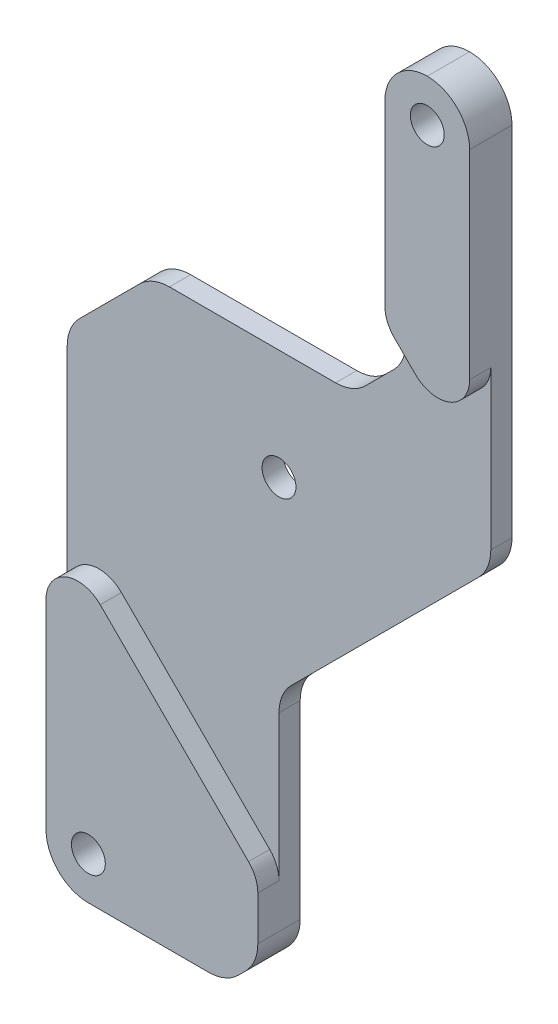
ISO-10303-21;
HEADER;
FILE_DESCRIPTION(('STEP AP214'),'2;1');
FILE_NAME('part.step','',(''),(''),'','','');
FILE_SCHEMA(('AUTOMOTIVE_DESIGN { 1 0 10303 214 1 1 1 1 }'));
ENDSEC;
DATA;
#1=APPLICATION_CONTEXT('core data for automotive mechanical design processes');
#2=APPLICATION_PROTOCOL_DEFINITION('international standard','automotive_design',2000,#1);
#3=PRODUCT_CONTEXT('',#1,'mechanical');
#4=PRODUCT('Part','Part','',(#3));
#5=PRODUCT_RELATED_PRODUCT_CATEGORY('part','',(#4));
#6=PRODUCT_DEFINITION_FORMATION('','',#4);
#7=PRODUCT_DEFINITION_CONTEXT('part definition',#1,'design');
#8=PRODUCT_DEFINITION('design','',#6,#7);
#9=PRODUCT_DEFINITION_SHAPE('','',#8);
#10=(LENGTH_UNIT() NAMED_UNIT(*) SI_UNIT(.MILLI.,.METRE.));
#11=(NAMED_UNIT(*) PLANE_ANGLE_UNIT() SI_UNIT($,.RADIAN.));
#12=(NAMED_UNIT(*) SI_UNIT($,.STERADIAN.) SOLID_ANGLE_UNIT());
#13=UNCERTAINTY_MEASURE_WITH_UNIT(LENGTH_MEASURE(1.E-05),#10,'distance_accuracy_value','');
#14=(GEOMETRIC_REPRESENTATION_CONTEXT(3) GLOBAL_UNCERTAINTY_ASSIGNED_CONTEXT((#13)) GLOBAL_UNIT_ASSIGNED_CONTEXT((#10,
#11,#12)) REPRESENTATION_CONTEXT('',''));
#15=CARTESIAN_POINT('',(0.,0.,0.));
#16=DIRECTION('',(0.,0.,1.));
#17=DIRECTION('',(1.,0.,0.));
#18=AXIS2_PLACEMENT_3D('',#15,#16,#17);
#19=CARTESIAN_POINT('',(0.,0.,4.));
#20=DIRECTION('',(0.,0.,-1.));
#21=DIRECTION('',(-1.,0.,0.));
#22=AXIS2_PLACEMENT_3D('',#19,#20,#21);
#23=PLANE('',#22);
#24=CARTESIAN_POINT('',(-16.,-136.,4.));
#25=DIRECTION('',(0.,0.,1.));
#26=DIRECTION('',(1.,0.,0.));
#27=AXIS2_PLACEMENT_3D('',#24,#25,#26);
#28=CIRCLE('',#27,1.59999999999999);
#29=CARTESIAN_POINT('',(-14.4,-136.,4.));
#30=VERTEX_POINT('',#29);
#31=EDGE_CURVE('E696',#30,#30,#28,.T.);
#32=ORIENTED_EDGE('',*,*,#31,.F.);
#33=EDGE_LOOP('',(#32));
#34=FACE_BOUND('',#33,.T.);
#35=DIRECTION('',(0.,-1.,0.));
#36=VECTOR('',#35,1.);
#37=CARTESIAN_POINT('',(0.,-115.8,4.));
#38=LINE('',#37,#36);
#39=CARTESIAN_POINT('',(0.,-131.18477631085,4.));
#40=VERTEX_POINT('',#39);
#41=CARTESIAN_POINT('',(0.,-135.343145750508,4.));
#42=VERTEX_POINT('',#41);
#43=EDGE_CURVE('E418',#40,#42,#38,.T.);
#44=ORIENTED_EDGE('',*,*,#43,.F.);
#45=CARTESIAN_POINT('',(-3.,-131.18477631085,4.));
#46=DIRECTION('',(0.,0.,-1.));
#47=DIRECTION('',(-1.,0.,0.));
#48=AXIS2_PLACEMENT_3D('',#45,#46,#47);
#49=CIRCLE('',#48,3.);
#50=CARTESIAN_POINT('',(-0.878679656440367,-129.063455967291,4.));
#51=VERTEX_POINT('',#50);
#52=EDGE_CURVE('E307',#40,#51,#49,.F.);
#53=ORIENTED_EDGE('',*,*,#52,.T.);
#54=DIRECTION('',(0.707106781186548,-0.707106781186547,0.));
#55=VECTOR('',#54,1.);
#56=CARTESIAN_POINT('',(0.,-129.942135623731,4.));
#57=LINE('',#56,#55);
#58=CARTESIAN_POINT('',(-14.8786796564404,-115.063455967291,4.));
#59=VERTEX_POINT('',#58);
#60=EDGE_CURVE('E580',#59,#51,#57,.T.);
#61=ORIENTED_EDGE('',*,*,#60,.F.);
#62=CARTESIAN_POINT('',(-17.,-117.18477631085,4.));
#63=DIRECTION('',(0.,0.,-1.));
#64=DIRECTION('',(-1.,0.,0.));
#65=AXIS2_PLACEMENT_3D('',#62,#63,#64);
#66=CIRCLE('',#65,3.);
#67=CARTESIAN_POINT('',(-20.,-117.18477631085,4.));
#68=VERTEX_POINT('',#67);
#69=EDGE_CURVE('E304',#59,#68,#66,.F.);
#70=ORIENTED_EDGE('',*,*,#69,.T.);
#71=DIRECTION('',(0.,1.,0.));
#72=VECTOR('',#71,1.);
#73=CARTESIAN_POINT('',(-20.,-140.,4.));
#74=LINE('',#73,#72);
#75=CARTESIAN_POINT('',(-20.,-136.,4.));
#76=VERTEX_POINT('',#75);
#77=EDGE_CURVE('E384',#76,#68,#74,.T.);
#78=ORIENTED_EDGE('',*,*,#77,.F.);
#79=CARTESIAN_POINT('',(-16.,-136.,4.));
#80=DIRECTION('',(0.,0.,-1.));
#81=DIRECTION('',(-1.,0.,0.));
#82=AXIS2_PLACEMENT_3D('',#79,#80,#81);
#83=CIRCLE('',#82,4.);
#84=CARTESIAN_POINT('',(-16.,-140.,4.));
#85=VERTEX_POINT('',#84);
#86=EDGE_CURVE('E428',#76,#85,#83,.F.);
#87=ORIENTED_EDGE('',*,*,#86,.T.);
#88=DIRECTION('',(-1.,0.,0.));
#89=VECTOR('',#88,1.);
#90=CARTESIAN_POINT('',(0.,-140.,4.));
#91=LINE('',#90,#89);
#92=CARTESIAN_POINT('',(-4.65685424949237,-140.,4.));
#93=VERTEX_POINT('',#92);
#94=EDGE_CURVE('E554',#93,#85,#91,.T.);
#95=ORIENTED_EDGE('',*,*,#94,.F.);
#96=CARTESIAN_POINT('',(-4.65685424949237,-136.,4.));
#97=DIRECTION('',(0.,0.,-1.));
#98=DIRECTION('',(-1.,0.,0.));
#99=AXIS2_PLACEMENT_3D('',#96,#97,#98);
#100=CIRCLE('',#99,4.);
#101=CARTESIAN_POINT('',(-1.82842712474618,-138.828427124746,4.));
#102=VERTEX_POINT('',#101);
#103=EDGE_CURVE('E500',#93,#102,#100,.F.);
#104=ORIENTED_EDGE('',*,*,#103,.T.);
#105=DIRECTION('',(-0.707106781186548,-0.707106781186548,0.));
#106=VECTOR('',#105,1.);
#107=CARTESIAN_POINT('',(0.,-137.,4.));
#108=LINE('',#107,#106);
#109=CARTESIAN_POINT('',(-1.17157287525382,-138.171572875254,4.));
#110=VERTEX_POINT('',#109);
#111=EDGE_CURVE('E456',#102,#110,#108,.F.);
#112=ORIENTED_EDGE('',*,*,#111,.T.);
#113=CARTESIAN_POINT('',(-4.,-135.343145750508,4.));
#114=DIRECTION('',(0.,0.,-1.));
#115=DIRECTION('',(-1.,0.,0.));
#116=AXIS2_PLACEMENT_3D('',#113,#114,#115);
#117=CIRCLE('',#116,4.);
#118=EDGE_CURVE('E496',#110,#42,#117,.F.);
#119=ORIENTED_EDGE('',*,*,#118,.T.);
#120=EDGE_LOOP('',(#44,#53,#61,#70,#78,#87,#95,#104,#112,#119));
#121=FACE_BOUND('',#120,.T.);
#122=ADVANCED_FACE('F39',(#34,#121),#23,.F.);
#123=CARTESIAN_POINT('',(0.,-115.8,4.));
#124=DIRECTION('',(1.,0.,0.));
#125=DIRECTION('',(0.,1.,0.));
#126=AXIS2_PLACEMENT_3D('',#123,#124,#125);
#127=PLANE('',#126);
#128=DIRECTION('',(0.,1.,0.));
#129=VECTOR('',#128,1.);
#130=CARTESIAN_POINT('',(0.,-115.8,2.));
#131=LINE('',#130,#129);
#132=CARTESIAN_POINT('',(0.,-131.18477631085,2.));
#133=VERTEX_POINT('',#132);
#134=CARTESIAN_POINT('',(0.,-117.456854249493,2.));
#135=VERTEX_POINT('',#134);
#136=EDGE_CURVE('E546',#133,#135,#131,.T.);
#137=ORIENTED_EDGE('',*,*,#136,.F.);
#138=DIRECTION('',(0.,0.,1.));
#139=VECTOR('',#138,1.);
#140=CARTESIAN_POINT('',(0.,-131.18477631085,4.));
#141=LINE('',#140,#139);
#142=EDGE_CURVE('E296',#133,#40,#141,.T.);
#143=ORIENTED_EDGE('',*,*,#142,.T.);
#144=ORIENTED_EDGE('',*,*,#43,.T.);
#145=DIRECTION('',(0.,0.,1.));
#146=VECTOR('',#145,1.);
#147=CARTESIAN_POINT('',(0.,-135.343145750508,4.));
#148=LINE('',#147,#146);
#149=CARTESIAN_POINT('',(0.,-135.343145750508,0.));
#150=VERTEX_POINT('',#149);
#151=EDGE_CURVE('E470',#42,#150,#148,.F.);
#152=ORIENTED_EDGE('',*,*,#151,.T.);
#153=DIRECTION('',(0.,-1.,0.));
#154=VECTOR('',#153,1.);
#155=CARTESIAN_POINT('',(0.,-115.8,0.));
#156=LINE('',#155,#154);
#157=CARTESIAN_POINT('',(0.,-117.456854249493,0.));
#158=VERTEX_POINT('',#157);
#159=EDGE_CURVE('E388',#158,#150,#156,.T.);
#160=ORIENTED_EDGE('',*,*,#159,.F.);
#161=DIRECTION('',(0.,0.,-1.));
#162=VECTOR('',#161,1.);
#163=CARTESIAN_POINT('',(0.,-117.456854249493,4.));
#164=LINE('',#163,#162);
#165=EDGE_CURVE('E474',#158,#135,#164,.F.);
#166=ORIENTED_EDGE('',*,*,#165,.T.);
#167=EDGE_LOOP('',(#137,#143,#144,#152,#160,#166));
#168=FACE_BOUND('',#167,.T.);
#169=ADVANCED_FACE('F630',(#168),#127,.T.);
#170=CARTESIAN_POINT('',(0.,-115.8,4.));
#171=DIRECTION('',(-0.707106781186551,0.707106781186544,0.));
#172=DIRECTION('',(-0.707106781186544,-0.707106781186551,0.));
#173=AXIS2_PLACEMENT_3D('',#170,#171,#172);
#174=PLANE('',#173);
#175=DIRECTION('',(0.,0.,-1.));
#176=VECTOR('',#175,1.);
#177=CARTESIAN_POINT('',(18.8284271247462,-96.9715728752538,4.));
#178=LINE('',#177,#176);
#179=CARTESIAN_POINT('',(18.8284271247462,-96.9715728752538,0.));
#180=VERTEX_POINT('',#179);
#181=CARTESIAN_POINT('',(18.8284271247462,-96.9715728752538,2.));
#182=VERTEX_POINT('',#181);
#183=EDGE_CURVE('E463',#180,#182,#178,.F.);
#184=ORIENTED_EDGE('',*,*,#183,.T.);
#185=DIRECTION('',(-0.707106781186544,-0.707106781186551,0.));
#186=VECTOR('',#185,1.);
#187=CARTESIAN_POINT('',(0.,-115.8,2.));
#188=LINE('',#187,#186);
#189=CARTESIAN_POINT('',(1.1715728752538,-114.628427124746,2.));
#190=VERTEX_POINT('',#189);
#191=EDGE_CURVE('E538',#182,#190,#188,.T.);
#192=ORIENTED_EDGE('',*,*,#191,.T.);
#193=DIRECTION('',(0.,0.,-1.));
#194=VECTOR('',#193,1.);
#195=CARTESIAN_POINT('',(1.17157287525379,-114.628427124746,4.));
#196=LINE('',#195,#194);
#197=CARTESIAN_POINT('',(1.1715728752538,-114.628427124746,0.));
#198=VERTEX_POINT('',#197);
#199=EDGE_CURVE('E467',#190,#198,#196,.T.);
#200=ORIENTED_EDGE('',*,*,#199,.T.);
#201=DIRECTION('',(0.707106781186544,0.707106781186552,0.));
#202=VECTOR('',#201,1.);
#203=CARTESIAN_POINT('',(0.,-115.8,0.));
#204=LINE('',#203,#202);
#205=EDGE_CURVE('E415',#198,#180,#204,.T.);
#206=ORIENTED_EDGE('',*,*,#205,.T.);
#207=EDGE_LOOP('',(#184,#192,#200,#206));
#208=FACE_BOUND('',#207,.T.);
#209=ADVANCED_FACE('F641',(#208),#174,.F.);
#210=CARTESIAN_POINT('',(20.,-56.4,4.));
#211=DIRECTION('',(1.,0.,0.));
#212=DIRECTION('',(0.,1.,0.));
#213=AXIS2_PLACEMENT_3D('',#210,#211,#212);
#214=PLANE('',#213);
#215=DIRECTION('',(0.,-1.,0.));
#216=VECTOR('',#215,1.);
#217=CARTESIAN_POINT('',(20.,-56.4,4.));
#218=LINE('',#217,#216);
#219=CARTESIAN_POINT('',(20.,-60.4,4.));
#220=VERTEX_POINT('',#219);
#221=CARTESIAN_POINT('',(20.,-79.2152236891496,4.));
#222=VERTEX_POINT('',#221);
#223=EDGE_CURVE('E367',#220,#222,#218,.T.);
#224=ORIENTED_EDGE('',*,*,#223,.T.);
#225=DIRECTION('',(0.,0.,1.));
#226=VECTOR('',#225,1.);
#227=CARTESIAN_POINT('',(20.,-79.2152236891496,2.));
#228=LINE('',#227,#226);
#229=CARTESIAN_POINT('',(20.,-79.2152236891496,2.));
#230=VERTEX_POINT('',#229);
#231=EDGE_CURVE('E334',#222,#230,#228,.F.);
#232=ORIENTED_EDGE('',*,*,#231,.T.);
#233=DIRECTION('',(0.,1.,0.));
#234=VECTOR('',#233,1.);
#235=CARTESIAN_POINT('',(20.,-56.4,2.));
#236=LINE('',#235,#234);
#237=CARTESIAN_POINT('',(20.,-94.1431457505076,2.));
#238=VERTEX_POINT('',#237);
#239=EDGE_CURVE('E61',#238,#230,#236,.T.);
#240=ORIENTED_EDGE('',*,*,#239,.F.);
#241=DIRECTION('',(0.,0.,-1.));
#242=VECTOR('',#241,1.);
#243=CARTESIAN_POINT('',(20.,-94.1431457505076,0.));
#244=LINE('',#243,#242);
#245=CARTESIAN_POINT('',(20.,-94.1431457505076,0.));
#246=VERTEX_POINT('',#245);
#247=EDGE_CURVE('E478',#238,#246,#244,.T.);
#248=ORIENTED_EDGE('',*,*,#247,.T.);
#249=DIRECTION('',(0.,-1.,0.));
#250=VECTOR('',#249,1.);
#251=CARTESIAN_POINT('',(20.,-56.4,0.));
#252=LINE('',#251,#250);
#253=CARTESIAN_POINT('',(20.,-60.4,0.));
#254=VERTEX_POINT('',#253);
#255=EDGE_CURVE('E411',#254,#246,#252,.T.);
#256=ORIENTED_EDGE('',*,*,#255,.F.);
#257=DIRECTION('',(0.,0.,-1.));
#258=VECTOR('',#257,1.);
#259=CARTESIAN_POINT('',(20.,-60.4,4.));
#260=LINE('',#259,#258);
#261=EDGE_CURVE('E374',#254,#220,#260,.F.);
#262=ORIENTED_EDGE('',*,*,#261,.T.);
#263=EDGE_LOOP('',(#224,#232,#240,#248,#256,#262));
#264=FACE_BOUND('',#263,.T.);
#265=ADVANCED_FACE('F371',(#264),#214,.T.);
#266=CARTESIAN_POINT('',(12.0000000000001,-87.8,4.));
#267=DIRECTION('',(-1.,0.,0.));
#268=DIRECTION('',(0.,-1.,0.));
#269=AXIS2_PLACEMENT_3D('',#266,#267,#268);
#270=PLANE('',#269);
#271=DIRECTION('',(0.,-1.,0.));
#272=VECTOR('',#271,1.);
#273=CARTESIAN_POINT('',(12.0000000000001,-87.8,2.));
#274=LINE('',#273,#272);
#275=CARTESIAN_POINT('',(12.0000000000001,-77.2152236891497,2.));
#276=VERTEX_POINT('',#275);
#277=CARTESIAN_POINT('',(12.0000000000001,-81.1431457505076,2.));
#278=VERTEX_POINT('',#277);
#279=EDGE_CURVE('E234',#276,#278,#274,.T.);
#280=ORIENTED_EDGE('',*,*,#279,.F.);
#281=DIRECTION('',(0.,0.,-1.));
#282=VECTOR('',#281,1.);
#283=CARTESIAN_POINT('',(12.0000000000001,-77.2152236891497,4.));
#284=LINE('',#283,#282);
#285=CARTESIAN_POINT('',(12.0000000000001,-77.2152236891497,4.));
#286=VERTEX_POINT('',#285);
#287=EDGE_CURVE('E325',#276,#286,#284,.F.);
#288=ORIENTED_EDGE('',*,*,#287,.T.);
#289=DIRECTION('',(0.,1.,0.));
#290=VECTOR('',#289,1.);
#291=CARTESIAN_POINT('',(12.0000000000001,-87.8,4.));
#292=LINE('',#291,#290);
#293=CARTESIAN_POINT('',(12.0000000000001,-60.4,4.));
#294=VERTEX_POINT('',#293);
#295=EDGE_CURVE('E377',#286,#294,#292,.T.);
#296=ORIENTED_EDGE('',*,*,#295,.T.);
#297=DIRECTION('',(0.,0.,-1.));
#298=VECTOR('',#297,1.);
#299=CARTESIAN_POINT('',(12.0000000000001,-60.4,4.));
#300=LINE('',#299,#298);
#301=CARTESIAN_POINT('',(12.0000000000001,-60.4,0.));
#302=VERTEX_POINT('',#301);
#303=EDGE_CURVE('E376',#294,#302,#300,.T.);
#304=ORIENTED_EDGE('',*,*,#303,.T.);
#305=DIRECTION('',(0.,1.,0.));
#306=VECTOR('',#305,1.);
#307=CARTESIAN_POINT('',(12.0000000000001,-87.8,0.));
#308=LINE('',#307,#306);
#309=CARTESIAN_POINT('',(12.0000000000001,-81.1431457505076,0.));
#310=VERTEX_POINT('',#309);
#311=EDGE_CURVE('E408',#310,#302,#308,.T.);
#312=ORIENTED_EDGE('',*,*,#311,.F.);
#313=DIRECTION('',(0.,0.,-1.));
#314=VECTOR('',#313,1.);
#315=CARTESIAN_POINT('',(12.0000000000001,-81.1431457505076,4.));
#316=LINE('',#315,#314);
#317=EDGE_CURVE('E285',#310,#278,#316,.F.);
#318=ORIENTED_EDGE('',*,*,#317,.T.);
#319=EDGE_LOOP('',(#280,#288,#296,#304,#312,#318));
#320=FACE_BOUND('',#319,.T.);
#321=ADVANCED_FACE('F660',(#320),#270,.T.);
#322=CARTESIAN_POINT('',(-12.,-87.8,4.));
#323=DIRECTION('',(0.,1.,0.));
#324=DIRECTION('',(0.,0.,1.));
#325=AXIS2_PLACEMENT_3D('',#322,#323,#324);
#326=PLANE('',#325);
#327=DIRECTION('',(-1.,0.,0.));
#328=VECTOR('',#327,1.);
#329=CARTESIAN_POINT('',(-12.,-87.8,2.));
#330=LINE('',#329,#328);
#331=CARTESIAN_POINT('',(5.34314575050766,-87.8,2.));
#332=VERTEX_POINT('',#331);
#333=CARTESIAN_POINT('',(-10.3431457505076,-87.8,2.));
#334=VERTEX_POINT('',#333);
#335=EDGE_CURVE('E509',#332,#334,#330,.T.);
#336=ORIENTED_EDGE('',*,*,#335,.F.);
#337=DIRECTION('',(0.,0.,1.));
#338=VECTOR('',#337,1.);
#339=CARTESIAN_POINT('',(5.34314575050766,-87.8,4.));
#340=LINE('',#339,#338);
#341=CARTESIAN_POINT('',(5.34314575050766,-87.8,0.));
#342=VERTEX_POINT('',#341);
#343=EDGE_CURVE('E256',#332,#342,#340,.F.);
#344=ORIENTED_EDGE('',*,*,#343,.T.);
#345=DIRECTION('',(1.,0.,0.));
#346=VECTOR('',#345,1.);
#347=CARTESIAN_POINT('',(-12.,-87.8,0.));
#348=LINE('',#347,#346);
#349=CARTESIAN_POINT('',(-10.3431457505076,-87.8,0.));
#350=VERTEX_POINT('',#349);
#351=EDGE_CURVE('E404',#350,#342,#348,.T.);
#352=ORIENTED_EDGE('',*,*,#351,.F.);
#353=DIRECTION('',(0.,0.,-1.));
#354=VECTOR('',#353,1.);
#355=CARTESIAN_POINT('',(-10.3431457505076,-87.8,4.));
#356=LINE('',#355,#354);
#357=EDGE_CURVE('E262',#350,#334,#356,.F.);
#358=ORIENTED_EDGE('',*,*,#357,.T.);
#359=EDGE_LOOP('',(#336,#344,#352,#358));
#360=FACE_BOUND('',#359,.T.);
#361=ADVANCED_FACE('F508',(#360),#326,.T.);
#362=CARTESIAN_POINT('',(-20.,-95.8,4.));
#363=DIRECTION('',(-0.707106781186548,0.707106781186547,0.));
#364=DIRECTION('',(-0.707106781186547,-0.707106781186548,0.));
#365=AXIS2_PLACEMENT_3D('',#362,#363,#364);
#366=PLANE('',#365);
#367=DIRECTION('',(-0.707106781186547,-0.707106781186548,0.));
#368=VECTOR('',#367,1.);
#369=CARTESIAN_POINT('',(-20.,-95.8,2.));
#370=LINE('',#369,#368);
#371=CARTESIAN_POINT('',(-13.1715728752538,-88.9715728752538,2.));
#372=VERTEX_POINT('',#371);
#373=CARTESIAN_POINT('',(-18.8284271247462,-94.6284271247462,2.));
#374=VERTEX_POINT('',#373);
#375=EDGE_CURVE('E519',#372,#374,#370,.T.);
#376=ORIENTED_EDGE('',*,*,#375,.F.);
#377=DIRECTION('',(0.,0.,-1.));
#378=VECTOR('',#377,1.);
#379=CARTESIAN_POINT('',(-13.1715728752538,-88.9715728752538,4.));
#380=LINE('',#379,#378);
#381=CARTESIAN_POINT('',(-13.1715728752538,-88.9715728752538,0.));
#382=VERTEX_POINT('',#381);
#383=EDGE_CURVE('E269',#372,#382,#380,.T.);
#384=ORIENTED_EDGE('',*,*,#383,.T.);
#385=DIRECTION('',(0.707106781186547,0.707106781186548,0.));
#386=VECTOR('',#385,1.);
#387=CARTESIAN_POINT('',(-20.,-95.8,0.));
#388=LINE('',#387,#386);
#389=CARTESIAN_POINT('',(-18.8284271247462,-94.6284271247462,0.));
#390=VERTEX_POINT('',#389);
#391=EDGE_CURVE('E400',#390,#382,#388,.T.);
#392=ORIENTED_EDGE('',*,*,#391,.F.);
#393=DIRECTION('',(0.,0.,-1.));
#394=VECTOR('',#393,1.);
#395=CARTESIAN_POINT('',(-18.8284271247462,-94.6284271247462,4.));
#396=LINE('',#395,#394);
#397=EDGE_CURVE('E260',#390,#374,#396,.F.);
#398=ORIENTED_EDGE('',*,*,#397,.T.);
#399=EDGE_LOOP('',(#376,#384,#392,#398));
#400=FACE_BOUND('',#399,.T.);
#401=ADVANCED_FACE('F600',(#400),#366,.T.);
#402=CARTESIAN_POINT('',(-20.,-140.,4.));
#403=DIRECTION('',(-1.,0.,0.));
#404=DIRECTION('',(0.,-1.,0.));
#405=AXIS2_PLACEMENT_3D('',#402,#403,#404);
#406=PLANE('',#405);
#407=ORIENTED_EDGE('',*,*,#77,.T.);
#408=DIRECTION('',(0.,0.,1.));
#409=VECTOR('',#408,1.);
#410=CARTESIAN_POINT('',(-20.,-117.18477631085,2.));
#411=LINE('',#410,#409);
#412=CARTESIAN_POINT('',(-20.,-117.18477631085,2.));
#413=VERTEX_POINT('',#412);
#414=EDGE_CURVE('E337',#68,#413,#411,.F.);
#415=ORIENTED_EDGE('',*,*,#414,.T.);
#416=DIRECTION('',(0.,-1.,0.));
#417=VECTOR('',#416,1.);
#418=CARTESIAN_POINT('',(-20.,-140.,2.));
#419=LINE('',#418,#417);
#420=CARTESIAN_POINT('',(-20.,-97.4568542494924,2.));
#421=VERTEX_POINT('',#420);
#422=EDGE_CURVE('E54',#421,#413,#419,.T.);
#423=ORIENTED_EDGE('',*,*,#422,.F.);
#424=DIRECTION('',(0.,0.,-1.));
#425=VECTOR('',#424,1.);
#426=CARTESIAN_POINT('',(-20.,-97.4568542494924,4.));
#427=LINE('',#426,#425);
#428=CARTESIAN_POINT('',(-20.,-97.4568542494924,0.));
#429=VERTEX_POINT('',#428);
#430=EDGE_CURVE('E272',#421,#429,#427,.T.);
#431=ORIENTED_EDGE('',*,*,#430,.T.);
#432=DIRECTION('',(0.,1.,0.));
#433=VECTOR('',#432,1.);
#434=CARTESIAN_POINT('',(-20.,-140.,0.));
#435=LINE('',#434,#433);
#436=CARTESIAN_POINT('',(-20.,-136.,0.));
#437=VERTEX_POINT('',#436);
#438=EDGE_CURVE('E396',#437,#429,#435,.T.);
#439=ORIENTED_EDGE('',*,*,#438,.F.);
#440=DIRECTION('',(0.,0.,-1.));
#441=VECTOR('',#440,1.);
#442=CARTESIAN_POINT('',(-20.,-136.,4.));
#443=LINE('',#442,#441);
#444=EDGE_CURVE('E445',#437,#76,#443,.F.);
#445=ORIENTED_EDGE('',*,*,#444,.T.);
#446=EDGE_LOOP('',(#407,#415,#423,#431,#439,#445));
#447=FACE_BOUND('',#446,.T.);
#448=ADVANCED_FACE('F561',(#447),#406,.T.);
#449=CARTESIAN_POINT('',(0.,-140.,4.));
#450=DIRECTION('',(0.,-1.,0.));
#451=DIRECTION('',(0.,0.,-1.));
#452=AXIS2_PLACEMENT_3D('',#449,#450,#451);
#453=PLANE('',#452);
#454=DIRECTION('',(-1.,0.,0.));
#455=VECTOR('',#454,1.);
#456=CARTESIAN_POINT('',(0.,-140.,0.));
#457=LINE('',#456,#455);
#458=CARTESIAN_POINT('',(-4.65685424949237,-140.,0.));
#459=VERTEX_POINT('',#458);
#460=CARTESIAN_POINT('',(-16.,-140.,0.));
#461=VERTEX_POINT('',#460);
#462=EDGE_CURVE('E392',#459,#461,#457,.T.);
#463=ORIENTED_EDGE('',*,*,#462,.F.);
#464=DIRECTION('',(0.,0.,-1.));
#465=VECTOR('',#464,1.);
#466=CARTESIAN_POINT('',(-4.65685424949237,-140.,4.));
#467=LINE('',#466,#465);
#468=EDGE_CURVE('E275',#459,#93,#467,.F.);
#469=ORIENTED_EDGE('',*,*,#468,.T.);
#470=ORIENTED_EDGE('',*,*,#94,.T.);
#471=DIRECTION('',(0.,0.,-1.));
#472=VECTOR('',#471,1.);
#473=CARTESIAN_POINT('',(-16.,-140.,4.));
#474=LINE('',#473,#472);
#475=EDGE_CURVE('E441',#85,#461,#474,.T.);
#476=ORIENTED_EDGE('',*,*,#475,.T.);
#477=EDGE_LOOP('',(#463,#469,#470,#476));
#478=FACE_BOUND('',#477,.T.);
#479=ADVANCED_FACE('F614',(#478),#453,.T.);
#480=CARTESIAN_POINT('',(16.0000000000001,-60.4,4.));
#481=DIRECTION('',(0.,0.,1.));
#482=DIRECTION('',(1.,0.,0.));
#483=AXIS2_PLACEMENT_3D('',#480,#481,#482);
#484=CIRCLE('',#483,1.6);
#485=CARTESIAN_POINT('',(17.6000000000001,-60.4,4.));
#486=VERTEX_POINT('',#485);
#487=EDGE_CURVE('E583',#486,#486,#484,.T.);
#488=ORIENTED_EDGE('',*,*,#487,.F.);
#489=EDGE_LOOP('',(#488));
#490=FACE_BOUND('',#489,.T.);
#491=ORIENTED_EDGE('',*,*,#295,.F.);
#492=CARTESIAN_POINT('',(15.0000000000001,-77.2152236891497,4.));
#493=DIRECTION('',(0.,0.,-1.));
#494=DIRECTION('',(-1.,0.,0.));
#495=AXIS2_PLACEMENT_3D('',#492,#493,#494);
#496=CIRCLE('',#495,3.);
#497=CARTESIAN_POINT('',(12.8786796564404,-79.3365440327093,4.));
#498=VERTEX_POINT('',#497);
#499=EDGE_CURVE('E331',#286,#498,#496,.F.);
#500=ORIENTED_EDGE('',*,*,#499,.T.);
#501=DIRECTION('',(-0.707106781186548,0.707106781186547,0.));
#502=VECTOR('',#501,1.);
#503=CARTESIAN_POINT('',(31.7421356237311,-98.2,4.));
#504=LINE('',#503,#502);
#505=CARTESIAN_POINT('',(14.8786796564404,-81.3365440327092,4.));
#506=VERTEX_POINT('',#505);
#507=EDGE_CURVE('E369',#506,#498,#504,.T.);
#508=ORIENTED_EDGE('',*,*,#507,.F.);
#509=CARTESIAN_POINT('',(17.,-79.2152236891496,4.));
#510=DIRECTION('',(0.,0.,-1.));
#511=DIRECTION('',(-1.,0.,0.));
#512=AXIS2_PLACEMENT_3D('',#509,#510,#511);
#513=CIRCLE('',#512,3.);
#514=EDGE_CURVE('E328',#506,#222,#513,.F.);
#515=ORIENTED_EDGE('',*,*,#514,.T.);
#516=ORIENTED_EDGE('',*,*,#223,.F.);
#517=CARTESIAN_POINT('',(16.,-60.4,4.));
#518=DIRECTION('',(0.,0.,-1.));
#519=DIRECTION('',(-1.,0.,0.));
#520=AXIS2_PLACEMENT_3D('',#517,#518,#519);
#521=CIRCLE('',#520,4.);
#522=CARTESIAN_POINT('',(16.,-56.4,4.));
#523=VERTEX_POINT('',#522);
#524=EDGE_CURVE('E432',#220,#523,#521,.F.);
#525=ORIENTED_EDGE('',*,*,#524,.T.);
#526=CARTESIAN_POINT('',(16.0000000000001,-60.4,4.));
#527=DIRECTION('',(0.,0.,-1.));
#528=DIRECTION('',(-1.,0.,0.));
#529=AXIS2_PLACEMENT_3D('',#526,#527,#528);
#530=CIRCLE('',#529,4.);
#531=EDGE_CURVE('E435',#523,#294,#530,.F.);
#532=ORIENTED_EDGE('',*,*,#531,.T.);
#533=EDGE_LOOP('',(#491,#500,#508,#515,#516,#525,#532));
#534=FACE_BOUND('',#533,.T.);
#535=ADVANCED_FACE('F366',(#490,#534),#23,.F.);
#536=CARTESIAN_POINT('',(0.,0.,0.));
#537=DIRECTION('',(0.,0.,-1.));
#538=DIRECTION('',(-1.,0.,0.));
#539=AXIS2_PLACEMENT_3D('',#536,#537,#538);
#540=PLANE('',#539);
#541=CARTESIAN_POINT('',(-16.,-136.,0.));
#542=DIRECTION('',(0.,0.,1.));
#543=DIRECTION('',(1.,0.,0.));
#544=AXIS2_PLACEMENT_3D('',#541,#542,#543);
#545=CIRCLE('',#544,1.59999999999999);
#546=CARTESIAN_POINT('',(-14.4,-136.,0.));
#547=VERTEX_POINT('',#546);
#548=EDGE_CURVE('E587',#547,#547,#545,.T.);
#549=ORIENTED_EDGE('',*,*,#548,.T.);
#550=EDGE_LOOP('',(#549));
#551=FACE_BOUND('',#550,.T.);
#552=CARTESIAN_POINT('',(16.0000000000001,-60.4,0.));
#553=DIRECTION('',(0.,0.,1.));
#554=DIRECTION('',(1.,0.,0.));
#555=AXIS2_PLACEMENT_3D('',#552,#553,#554);
#556=CIRCLE('',#555,1.6);
#557=CARTESIAN_POINT('',(17.6000000000001,-60.4,0.));
#558=VERTEX_POINT('',#557);
#559=EDGE_CURVE('E693',#558,#558,#556,.T.);
#560=ORIENTED_EDGE('',*,*,#559,.T.);
#561=EDGE_LOOP('',(#560));
#562=FACE_BOUND('',#561,.T.);
#563=CARTESIAN_POINT('',(0.,-98.2,0.));
#564=DIRECTION('',(0.,0.,1.));
#565=DIRECTION('',(1.,0.,0.));
#566=AXIS2_PLACEMENT_3D('',#563,#564,#565);
#567=CIRCLE('',#566,1.6);
#568=CARTESIAN_POINT('',(1.6,-98.2,0.));
#569=VERTEX_POINT('',#568);
#570=EDGE_CURVE('E452',#569,#569,#567,.T.);
#571=ORIENTED_EDGE('',*,*,#570,.T.);
#572=EDGE_LOOP('',(#571));
#573=FACE_BOUND('',#572,.T.);
#574=ORIENTED_EDGE('',*,*,#255,.T.);
#575=CARTESIAN_POINT('',(16.,-94.1431457505076,0.));
#576=DIRECTION('',(0.,0.,-1.));
#577=DIRECTION('',(-1.,0.,0.));
#578=AXIS2_PLACEMENT_3D('',#575,#576,#577);
#579=CIRCLE('',#578,4.);
#580=EDGE_CURVE('E493',#246,#180,#579,.T.);
#581=ORIENTED_EDGE('',*,*,#580,.T.);
#582=ORIENTED_EDGE('',*,*,#205,.F.);
#583=CARTESIAN_POINT('',(4.,-117.456854249493,0.));
#584=DIRECTION('',(0.,0.,-1.));
#585=DIRECTION('',(-1.,0.,0.));
#586=AXIS2_PLACEMENT_3D('',#583,#584,#585);
#587=CIRCLE('',#586,4.);
#588=EDGE_CURVE('E288',#198,#158,#587,.F.);
#589=ORIENTED_EDGE('',*,*,#588,.T.);
#590=ORIENTED_EDGE('',*,*,#159,.T.);
#591=CARTESIAN_POINT('',(-4.,-135.343145750508,0.));
#592=DIRECTION('',(0.,0.,-1.));
#593=DIRECTION('',(-1.,0.,0.));
#594=AXIS2_PLACEMENT_3D('',#591,#592,#593);
#595=CIRCLE('',#594,4.);
#596=CARTESIAN_POINT('',(-1.17157287525384,-138.171572875254,0.));
#597=VERTEX_POINT('',#596);
#598=EDGE_CURVE('E481',#150,#597,#595,.T.);
#599=ORIENTED_EDGE('',*,*,#598,.T.);
#600=DIRECTION('',(0.707106781186548,0.707106781186548,0.));
#601=VECTOR('',#600,1.);
#602=CARTESIAN_POINT('',(68.5,-68.5,0.));
#603=LINE('',#602,#601);
#604=CARTESIAN_POINT('',(-1.82842712474619,-138.828427124746,0.));
#605=VERTEX_POINT('',#604);
#606=EDGE_CURVE('E448',#597,#605,#603,.F.);
#607=ORIENTED_EDGE('',*,*,#606,.T.);
#608=CARTESIAN_POINT('',(-4.65685424949237,-136.,0.));
#609=DIRECTION('',(0.,0.,-1.));
#610=DIRECTION('',(-1.,0.,0.));
#611=AXIS2_PLACEMENT_3D('',#608,#609,#610);
#612=CIRCLE('',#611,4.);
#613=EDGE_CURVE('E484',#605,#459,#612,.T.);
#614=ORIENTED_EDGE('',*,*,#613,.T.);
#615=ORIENTED_EDGE('',*,*,#462,.T.);
#616=CARTESIAN_POINT('',(-16.,-136.,0.));
#617=DIRECTION('',(0.,0.,-1.));
#618=DIRECTION('',(-1.,0.,0.));
#619=AXIS2_PLACEMENT_3D('',#616,#617,#618);
#620=CIRCLE('',#619,4.);
#621=EDGE_CURVE('E382',#461,#437,#620,.T.);
#622=ORIENTED_EDGE('',*,*,#621,.T.);
#623=ORIENTED_EDGE('',*,*,#438,.T.);
#624=CARTESIAN_POINT('',(-16.,-97.4568542494924,0.));
#625=DIRECTION('',(0.,0.,-1.));
#626=DIRECTION('',(-1.,0.,0.));
#627=AXIS2_PLACEMENT_3D('',#624,#625,#626);
#628=CIRCLE('',#627,4.);
#629=EDGE_CURVE('E487',#429,#390,#628,.T.);
#630=ORIENTED_EDGE('',*,*,#629,.T.);
#631=ORIENTED_EDGE('',*,*,#391,.T.);
#632=CARTESIAN_POINT('',(-10.3431457505076,-91.8,0.));
#633=DIRECTION('',(0.,0.,-1.));
#634=DIRECTION('',(-1.,0.,0.));
#635=AXIS2_PLACEMENT_3D('',#632,#633,#634);
#636=CIRCLE('',#635,4.);
#637=EDGE_CURVE('E490',#382,#350,#636,.T.);
#638=ORIENTED_EDGE('',*,*,#637,.T.);
#639=ORIENTED_EDGE('',*,*,#351,.T.);
#640=CARTESIAN_POINT('',(5.34314575050766,-83.8,0.));
#641=DIRECTION('',(0.,0.,-1.));
#642=DIRECTION('',(-1.,0.,0.));
#643=AXIS2_PLACEMENT_3D('',#640,#641,#642);
#644=CIRCLE('',#643,4.);
#645=CARTESIAN_POINT('',(8.17157287525383,-86.6284271247462,0.));
#646=VERTEX_POINT('',#645);
#647=EDGE_CURVE('E291',#342,#646,#644,.F.);
#648=ORIENTED_EDGE('',*,*,#647,.T.);
#649=DIRECTION('',(-0.707106781186551,-0.707106781186544,0.));
#650=VECTOR('',#649,1.);
#651=CARTESIAN_POINT('',(7.00000000000002,-87.8,0.));
#652=LINE('',#651,#650);
#653=CARTESIAN_POINT('',(10.8284271247462,-83.9715728752538,0.));
#654=VERTEX_POINT('',#653);
#655=EDGE_CURVE('E460',#646,#654,#652,.F.);
#656=ORIENTED_EDGE('',*,*,#655,.T.);
#657=CARTESIAN_POINT('',(8.00000000000007,-81.1431457505076,0.));
#658=DIRECTION('',(0.,0.,-1.));
#659=DIRECTION('',(-1.,0.,0.));
#660=AXIS2_PLACEMENT_3D('',#657,#658,#659);
#661=CIRCLE('',#660,4.);
#662=EDGE_CURVE('E254',#654,#310,#661,.F.);
#663=ORIENTED_EDGE('',*,*,#662,.T.);
#664=ORIENTED_EDGE('',*,*,#311,.T.);
#665=CARTESIAN_POINT('',(16.0000000000001,-60.4,0.));
#666=DIRECTION('',(0.,0.,-1.));
#667=DIRECTION('',(-1.,0.,0.));
#668=AXIS2_PLACEMENT_3D('',#665,#666,#667);
#669=CIRCLE('',#668,4.);
#670=CARTESIAN_POINT('',(16.,-56.4,0.));
#671=VERTEX_POINT('',#670);
#672=EDGE_CURVE('E425',#302,#671,#669,.T.);
#673=ORIENTED_EDGE('',*,*,#672,.T.);
#674=CARTESIAN_POINT('',(16.,-60.4,0.));
#675=DIRECTION('',(0.,0.,-1.));
#676=DIRECTION('',(-1.,0.,0.));
#677=AXIS2_PLACEMENT_3D('',#674,#675,#676);
#678=CIRCLE('',#677,4.);
#679=EDGE_CURVE('E422',#671,#254,#678,.T.);
#680=ORIENTED_EDGE('',*,*,#679,.T.);
#681=EDGE_LOOP('',(#574,#581,#582,#589,#590,#599,#607,#614,#615,#622,#623,#630,#631,#638,#639,
#648,#656,#663,#664,#673,#680));
#682=FACE_BOUND('',#681,.T.);
#683=ADVANCED_FACE('F595',(#551,#562,#573,#682),#540,.T.);
#684=CARTESIAN_POINT('',(16.,-60.4,4.));
#685=DIRECTION('',(0.,0.,-1.));
#686=DIRECTION('',(-1.,0.,0.));
#687=AXIS2_PLACEMENT_3D('',#684,#685,#686);
#688=CYLINDRICAL_SURFACE('',#687,4.);
#689=DIRECTION('',(0.,0.,-1.));
#690=VECTOR('',#689,1.);
#691=CARTESIAN_POINT('',(16.,-56.4,4.));
#692=LINE('',#691,#690);
#693=EDGE_CURVE('E393',#523,#671,#692,.T.);
#694=ORIENTED_EDGE('',*,*,#693,.F.);
#695=ORIENTED_EDGE('',*,*,#524,.F.);
#696=ORIENTED_EDGE('',*,*,#261,.F.);
#697=ORIENTED_EDGE('',*,*,#679,.F.);
#698=EDGE_LOOP('',(#694,#695,#696,#697));
#699=FACE_BOUND('',#698,.T.);
#700=ADVANCED_FACE('F651',(#699),#688,.T.);
#701=CARTESIAN_POINT('',(16.0000000000001,-60.4,4.));
#702=DIRECTION('',(0.,0.,-1.));
#703=DIRECTION('',(-1.,0.,0.));
#704=AXIS2_PLACEMENT_3D('',#701,#702,#703);
#705=CYLINDRICAL_SURFACE('',#704,4.);
#706=ORIENTED_EDGE('',*,*,#531,.F.);
#707=ORIENTED_EDGE('',*,*,#693,.T.);
#708=ORIENTED_EDGE('',*,*,#672,.F.);
#709=ORIENTED_EDGE('',*,*,#303,.F.);
#710=EDGE_LOOP('',(#706,#707,#708,#709));
#711=FACE_BOUND('',#710,.T.);
#712=ADVANCED_FACE('F657',(#711),#705,.T.);
#713=CARTESIAN_POINT('',(-16.,-136.,4.));
#714=DIRECTION('',(0.,0.,-1.));
#715=DIRECTION('',(-1.,0.,0.));
#716=AXIS2_PLACEMENT_3D('',#713,#714,#715);
#717=CYLINDRICAL_SURFACE('',#716,4.);
#718=ORIENTED_EDGE('',*,*,#86,.F.);
#719=ORIENTED_EDGE('',*,*,#444,.F.);
#720=ORIENTED_EDGE('',*,*,#621,.F.);
#721=ORIENTED_EDGE('',*,*,#475,.F.);
#722=EDGE_LOOP('',(#718,#719,#720,#721));
#723=FACE_BOUND('',#722,.T.);
#724=ADVANCED_FACE('F607',(#723),#717,.T.);
#725=CARTESIAN_POINT('',(0.,-137.,4.));
#726=DIRECTION('',(-0.707106781186547,0.707106781186547,0.));
#727=DIRECTION('',(0.,0.,-1.));
#728=AXIS2_PLACEMENT_3D('',#725,#726,#727);
#729=PLANE('',#728);
#730=ORIENTED_EDGE('',*,*,#111,.F.);
#731=DIRECTION('',(0.,0.,1.));
#732=VECTOR('',#731,1.);
#733=CARTESIAN_POINT('',(-1.82842712474618,-138.828427124746,4.));
#734=LINE('',#733,#732);
#735=EDGE_CURVE('E282',#102,#605,#734,.F.);
#736=ORIENTED_EDGE('',*,*,#735,.T.);
#737=ORIENTED_EDGE('',*,*,#606,.F.);
#738=DIRECTION('',(0.,0.,-1.));
#739=VECTOR('',#738,1.);
#740=CARTESIAN_POINT('',(-1.17157287525382,-138.171572875254,4.));
#741=LINE('',#740,#739);
#742=EDGE_CURVE('E279',#597,#110,#741,.F.);
#743=ORIENTED_EDGE('',*,*,#742,.T.);
#744=EDGE_LOOP('',(#730,#736,#737,#743));
#745=FACE_BOUND('',#744,.T.);
#746=ADVANCED_FACE('F622',(#745),#729,.F.);
#747=CARTESIAN_POINT('',(7.00000000000002,-87.8,4.));
#748=DIRECTION('',(-0.707106781186543,0.707106781186551,0.));
#749=DIRECTION('',(0.,0.,1.));
#750=AXIS2_PLACEMENT_3D('',#747,#748,#749);
#751=PLANE('',#750);
#752=DIRECTION('',(0.,0.,-1.));
#753=VECTOR('',#752,1.);
#754=CARTESIAN_POINT('',(8.17157287525383,-86.6284271247462,4.));
#755=LINE('',#754,#753);
#756=CARTESIAN_POINT('',(8.17157287525383,-86.6284271247462,2.));
#757=VERTEX_POINT('',#756);
#758=EDGE_CURVE('E249',#646,#757,#755,.F.);
#759=ORIENTED_EDGE('',*,*,#758,.T.);
#760=DIRECTION('',(-0.707106781186551,-0.707106781186544,0.));
#761=VECTOR('',#760,1.);
#762=CARTESIAN_POINT('',(7.00000000000002,-87.8,2.));
#763=LINE('',#762,#761);
#764=CARTESIAN_POINT('',(10.8284271247462,-83.9715728752538,2.));
#765=VERTEX_POINT('',#764);
#766=EDGE_CURVE('E231',#757,#765,#763,.F.);
#767=ORIENTED_EDGE('',*,*,#766,.T.);
#768=DIRECTION('',(0.,0.,1.));
#769=VECTOR('',#768,1.);
#770=CARTESIAN_POINT('',(10.8284271247462,-83.9715728752538,4.));
#771=LINE('',#770,#769);
#772=EDGE_CURVE('E246',#765,#654,#771,.F.);
#773=ORIENTED_EDGE('',*,*,#772,.T.);
#774=ORIENTED_EDGE('',*,*,#655,.F.);
#775=EDGE_LOOP('',(#759,#767,#773,#774));
#776=FACE_BOUND('',#775,.T.);
#777=ADVANCED_FACE('F244',(#776),#751,.T.);
#778=CARTESIAN_POINT('',(4.,-117.456854249493,4.));
#779=DIRECTION('',(0.,0.,-1.));
#780=DIRECTION('',(-1.,0.,0.));
#781=AXIS2_PLACEMENT_3D('',#778,#779,#780);
#782=CYLINDRICAL_SURFACE('',#781,4.);
#783=ORIENTED_EDGE('',*,*,#199,.F.);
#784=CARTESIAN_POINT('',(4.,-117.456854249493,2.));
#785=DIRECTION('',(0.,0.,-1.));
#786=DIRECTION('',(-1.,0.,0.));
#787=AXIS2_PLACEMENT_3D('',#784,#785,#786);
#788=CIRCLE('',#787,4.);
#789=EDGE_CURVE('E542',#190,#135,#788,.F.);
#790=ORIENTED_EDGE('',*,*,#789,.T.);
#791=ORIENTED_EDGE('',*,*,#165,.F.);
#792=ORIENTED_EDGE('',*,*,#588,.F.);
#793=EDGE_LOOP('',(#783,#790,#791,#792));
#794=FACE_BOUND('',#793,.T.);
#795=ADVANCED_FACE('F637',(#794),#782,.F.);
#796=CARTESIAN_POINT('',(16.,-94.1431457505076,4.));
#797=DIRECTION('',(0.,0.,1.));
#798=DIRECTION('',(1.,0.,0.));
#799=AXIS2_PLACEMENT_3D('',#796,#797,#798);
#800=CYLINDRICAL_SURFACE('',#799,4.);
#801=CARTESIAN_POINT('',(16.,-94.1431457505076,2.));
#802=DIRECTION('',(0.,0.,-1.));
#803=DIRECTION('',(-1.,0.,0.));
#804=AXIS2_PLACEMENT_3D('',#801,#802,#803);
#805=CIRCLE('',#804,4.);
#806=EDGE_CURVE('E533',#182,#238,#805,.F.);
#807=ORIENTED_EDGE('',*,*,#806,.F.);
#808=ORIENTED_EDGE('',*,*,#183,.F.);
#809=ORIENTED_EDGE('',*,*,#580,.F.);
#810=ORIENTED_EDGE('',*,*,#247,.F.);
#811=EDGE_LOOP('',(#807,#808,#809,#810));
#812=FACE_BOUND('',#811,.T.);
#813=ADVANCED_FACE('F646',(#812),#800,.T.);
#814=CARTESIAN_POINT('',(5.34314575050766,-83.8,4.));
#815=DIRECTION('',(0.,0.,1.));
#816=DIRECTION('',(1.,0.,0.));
#817=AXIS2_PLACEMENT_3D('',#814,#815,#816);
#818=CYLINDRICAL_SURFACE('',#817,4.);
#819=ORIENTED_EDGE('',*,*,#343,.F.);
#820=CARTESIAN_POINT('',(5.34314575050766,-83.8,2.));
#821=DIRECTION('',(0.,0.,-1.));
#822=DIRECTION('',(-1.,0.,0.));
#823=AXIS2_PLACEMENT_3D('',#820,#821,#822);
#824=CIRCLE('',#823,4.);
#825=EDGE_CURVE('E525',#332,#757,#824,.F.);
#826=ORIENTED_EDGE('',*,*,#825,.T.);
#827=ORIENTED_EDGE('',*,*,#758,.F.);
#828=ORIENTED_EDGE('',*,*,#647,.F.);
#829=EDGE_LOOP('',(#819,#826,#827,#828));
#830=FACE_BOUND('',#829,.T.);
#831=ADVANCED_FACE('F592',(#830),#818,.F.);
#832=CARTESIAN_POINT('',(-10.3431457505076,-91.8,4.));
#833=DIRECTION('',(0.,0.,-1.));
#834=DIRECTION('',(-1.,0.,0.));
#835=AXIS2_PLACEMENT_3D('',#832,#833,#834);
#836=CYLINDRICAL_SURFACE('',#835,4.);
#837=CARTESIAN_POINT('',(-10.3431457505076,-91.8,2.));
#838=DIRECTION('',(0.,0.,-1.));
#839=DIRECTION('',(-1.,0.,0.));
#840=AXIS2_PLACEMENT_3D('',#837,#838,#839);
#841=CIRCLE('',#840,4.);
#842=EDGE_CURVE('E516',#334,#372,#841,.F.);
#843=ORIENTED_EDGE('',*,*,#842,.F.);
#844=ORIENTED_EDGE('',*,*,#357,.F.);
#845=ORIENTED_EDGE('',*,*,#637,.F.);
#846=ORIENTED_EDGE('',*,*,#383,.F.);
#847=EDGE_LOOP('',(#843,#844,#845,#846));
#848=FACE_BOUND('',#847,.T.);
#849=ADVANCED_FACE('F514',(#848),#836,.T.);
#850=CARTESIAN_POINT('',(-16.,-97.4568542494924,4.));
#851=DIRECTION('',(0.,0.,-1.));
#852=DIRECTION('',(-1.,0.,0.));
#853=AXIS2_PLACEMENT_3D('',#850,#851,#852);
#854=CYLINDRICAL_SURFACE('',#853,4.);
#855=CARTESIAN_POINT('',(-16.,-97.4568542494924,2.));
#856=DIRECTION('',(0.,0.,-1.));
#857=DIRECTION('',(-1.,0.,0.));
#858=AXIS2_PLACEMENT_3D('',#855,#856,#857);
#859=CIRCLE('',#858,4.);
#860=EDGE_CURVE('E523',#374,#421,#859,.F.);
#861=ORIENTED_EDGE('',*,*,#860,.F.);
#862=ORIENTED_EDGE('',*,*,#397,.F.);
#863=ORIENTED_EDGE('',*,*,#629,.F.);
#864=ORIENTED_EDGE('',*,*,#430,.F.);
#865=EDGE_LOOP('',(#861,#862,#863,#864));
#866=FACE_BOUND('',#865,.T.);
#867=ADVANCED_FACE('F603',(#866),#854,.T.);
#868=CARTESIAN_POINT('',(-4.65685424949237,-136.,4.));
#869=DIRECTION('',(0.,0.,-1.));
#870=DIRECTION('',(-1.,0.,0.));
#871=AXIS2_PLACEMENT_3D('',#868,#869,#870);
#872=CYLINDRICAL_SURFACE('',#871,4.);
#873=ORIENTED_EDGE('',*,*,#613,.F.);
#874=ORIENTED_EDGE('',*,*,#735,.F.);
#875=ORIENTED_EDGE('',*,*,#103,.F.);
#876=ORIENTED_EDGE('',*,*,#468,.F.);
#877=EDGE_LOOP('',(#873,#874,#875,#876));
#878=FACE_BOUND('',#877,.T.);
#879=ADVANCED_FACE('F618',(#878),#872,.T.);
#880=CARTESIAN_POINT('',(-4.,-135.343145750508,4.));
#881=DIRECTION('',(0.,0.,1.));
#882=DIRECTION('',(1.,0.,0.));
#883=AXIS2_PLACEMENT_3D('',#880,#881,#882);
#884=CYLINDRICAL_SURFACE('',#883,4.);
#885=ORIENTED_EDGE('',*,*,#118,.F.);
#886=ORIENTED_EDGE('',*,*,#742,.F.);
#887=ORIENTED_EDGE('',*,*,#598,.F.);
#888=ORIENTED_EDGE('',*,*,#151,.F.);
#889=EDGE_LOOP('',(#885,#886,#887,#888));
#890=FACE_BOUND('',#889,.T.);
#891=ADVANCED_FACE('F628',(#890),#884,.T.);
#892=CARTESIAN_POINT('',(8.00000000000007,-81.1431457505076,4.));
#893=DIRECTION('',(0.,0.,-1.));
#894=DIRECTION('',(-1.,0.,0.));
#895=AXIS2_PLACEMENT_3D('',#892,#893,#894);
#896=CYLINDRICAL_SURFACE('',#895,4.);
#897=ORIENTED_EDGE('',*,*,#772,.F.);
#898=CARTESIAN_POINT('',(8.00000000000007,-81.1431457505076,2.));
#899=DIRECTION('',(0.,0.,-1.));
#900=DIRECTION('',(-1.,0.,0.));
#901=AXIS2_PLACEMENT_3D('',#898,#899,#900);
#902=CIRCLE('',#901,4.);
#903=EDGE_CURVE('E227',#765,#278,#902,.F.);
#904=ORIENTED_EDGE('',*,*,#903,.T.);
#905=ORIENTED_EDGE('',*,*,#317,.F.);
#906=ORIENTED_EDGE('',*,*,#662,.F.);
#907=EDGE_LOOP('',(#897,#904,#905,#906));
#908=FACE_BOUND('',#907,.T.);
#909=ADVANCED_FACE('F253',(#908),#896,.F.);
#910=CARTESIAN_POINT('',(0.,-98.2,0.));
#911=DIRECTION('',(0.,0.,1.));
#912=DIRECTION('',(1.,0.,0.));
#913=AXIS2_PLACEMENT_3D('',#910,#911,#912);
#914=CYLINDRICAL_SURFACE('',#913,1.6);
#915=CARTESIAN_POINT('',(0.,-98.2,2.));
#916=DIRECTION('',(0.,0.,-1.));
#917=DIRECTION('',(-1.,0.,0.));
#918=AXIS2_PLACEMENT_3D('',#915,#916,#917);
#919=CIRCLE('',#918,1.6);
#920=CARTESIAN_POINT('',(-1.6,-98.2,2.));
#921=VERTEX_POINT('',#920);
#922=EDGE_CURVE('E240',#921,#921,#919,.F.);
#923=ORIENTED_EDGE('',*,*,#922,.T.);
#924=EDGE_LOOP('',(#923));
#925=FACE_BOUND('',#924,.T.);
#926=ORIENTED_EDGE('',*,*,#570,.F.);
#927=EDGE_LOOP('',(#926));
#928=FACE_BOUND('',#927,.T.);
#929=ADVANCED_FACE('F720',(#925,#928),#914,.F.);
#930=CARTESIAN_POINT('',(0.,0.,2.));
#931=DIRECTION('',(0.,0.,-1.));
#932=DIRECTION('',(-1.,0.,0.));
#933=AXIS2_PLACEMENT_3D('',#930,#931,#932);
#934=PLANE('',#933);
#935=ORIENTED_EDGE('',*,*,#136,.T.);
#936=ORIENTED_EDGE('',*,*,#789,.F.);
#937=ORIENTED_EDGE('',*,*,#191,.F.);
#938=ORIENTED_EDGE('',*,*,#806,.T.);
#939=ORIENTED_EDGE('',*,*,#239,.T.);
#940=CARTESIAN_POINT('',(17.,-79.2152236891496,2.));
#941=DIRECTION('',(0.,0.,-1.));
#942=DIRECTION('',(-1.,0.,0.));
#943=AXIS2_PLACEMENT_3D('',#940,#941,#942);
#944=CIRCLE('',#943,3.);
#945=CARTESIAN_POINT('',(14.8786796564404,-81.3365440327092,2.));
#946=VERTEX_POINT('',#945);
#947=EDGE_CURVE('E48',#230,#946,#944,.T.);
#948=ORIENTED_EDGE('',*,*,#947,.T.);
#949=DIRECTION('',(-0.707106781186548,0.707106781186547,0.));
#950=VECTOR('',#949,1.);
#951=CARTESIAN_POINT('',(31.7421356237311,-98.2,2.));
#952=LINE('',#951,#950);
#953=CARTESIAN_POINT('',(12.8786796564404,-79.3365440327093,2.));
#954=VERTEX_POINT('',#953);
#955=EDGE_CURVE('E300',#946,#954,#952,.T.);
#956=ORIENTED_EDGE('',*,*,#955,.T.);
#957=CARTESIAN_POINT('',(15.0000000000001,-77.2152236891497,2.));
#958=DIRECTION('',(0.,0.,-1.));
#959=DIRECTION('',(-1.,0.,0.));
#960=AXIS2_PLACEMENT_3D('',#957,#958,#959);
#961=CIRCLE('',#960,3.);
#962=EDGE_CURVE('E344',#954,#276,#961,.T.);
#963=ORIENTED_EDGE('',*,*,#962,.T.);
#964=ORIENTED_EDGE('',*,*,#279,.T.);
#965=ORIENTED_EDGE('',*,*,#903,.F.);
#966=ORIENTED_EDGE('',*,*,#766,.F.);
#967=ORIENTED_EDGE('',*,*,#825,.F.);
#968=ORIENTED_EDGE('',*,*,#335,.T.);
#969=ORIENTED_EDGE('',*,*,#842,.T.);
#970=ORIENTED_EDGE('',*,*,#375,.T.);
#971=ORIENTED_EDGE('',*,*,#860,.T.);
#972=ORIENTED_EDGE('',*,*,#422,.T.);
#973=CARTESIAN_POINT('',(-17.,-117.18477631085,2.));
#974=DIRECTION('',(0.,0.,-1.));
#975=DIRECTION('',(-1.,0.,0.));
#976=AXIS2_PLACEMENT_3D('',#973,#974,#975);
#977=CIRCLE('',#976,3.);
#978=CARTESIAN_POINT('',(-14.8786796564404,-115.063455967291,2.));
#979=VERTEX_POINT('',#978);
#980=EDGE_CURVE('E11',#413,#979,#977,.T.);
#981=ORIENTED_EDGE('',*,*,#980,.T.);
#982=DIRECTION('',(0.707106781186548,-0.707106781186547,0.));
#983=VECTOR('',#982,1.);
#984=CARTESIAN_POINT('',(0.,-129.942135623731,2.));
#985=LINE('',#984,#983);
#986=CARTESIAN_POINT('',(-0.878679656440367,-129.063455967291,2.));
#987=VERTEX_POINT('',#986);
#988=EDGE_CURVE('E359',#979,#987,#985,.T.);
#989=ORIENTED_EDGE('',*,*,#988,.T.);
#990=CARTESIAN_POINT('',(-3.,-131.18477631085,2.));
#991=DIRECTION('',(0.,0.,-1.));
#992=DIRECTION('',(-1.,0.,0.));
#993=AXIS2_PLACEMENT_3D('',#990,#991,#992);
#994=CIRCLE('',#993,3.);
#995=EDGE_CURVE('E340',#987,#133,#994,.T.);
#996=ORIENTED_EDGE('',*,*,#995,.T.);
#997=EDGE_LOOP('',(#935,#936,#937,#938,#939,#948,#956,#963,#964,#965,#966,#967,#968,#969,#970,
#971,#972,#981,#989,#996));
#998=FACE_BOUND('',#997,.T.);
#999=ORIENTED_EDGE('',*,*,#922,.F.);
#1000=EDGE_LOOP('',(#999));
#1001=FACE_BOUND('',#1000,.T.);
#1002=ADVANCED_FACE('F229',(#998,#1001),#934,.F.);
#1003=CARTESIAN_POINT('',(0.,-129.942135623731,2.));
#1004=DIRECTION('',(-0.707106781186547,-0.707106781186548,0.));
#1005=DIRECTION('',(0.707106781186548,-0.707106781186547,0.));
#1006=AXIS2_PLACEMENT_3D('',#1003,#1004,#1005);
#1007=PLANE('',#1006);
#1008=ORIENTED_EDGE('',*,*,#60,.T.);
#1009=DIRECTION('',(0.,0.,1.));
#1010=VECTOR('',#1009,1.);
#1011=CARTESIAN_POINT('',(-0.878679656440366,-129.063455967291,2.));
#1012=LINE('',#1011,#1010);
#1013=EDGE_CURVE('E314',#51,#987,#1012,.F.);
#1014=ORIENTED_EDGE('',*,*,#1013,.T.);
#1015=ORIENTED_EDGE('',*,*,#988,.F.);
#1016=DIRECTION('',(0.,0.,1.));
#1017=VECTOR('',#1016,1.);
#1018=CARTESIAN_POINT('',(-14.8786796564404,-115.063455967291,4.));
#1019=LINE('',#1018,#1017);
#1020=EDGE_CURVE('E310',#979,#59,#1019,.T.);
#1021=ORIENTED_EDGE('',*,*,#1020,.T.);
#1022=EDGE_LOOP('',(#1008,#1014,#1015,#1021));
#1023=FACE_BOUND('',#1022,.T.);
#1024=ADVANCED_FACE('F574',(#1023),#1007,.F.);
#1025=CARTESIAN_POINT('',(31.7421356237311,-98.2,2.));
#1026=DIRECTION('',(0.707106781186547,0.707106781186548,0.));
#1027=DIRECTION('',(-0.707106781186548,0.707106781186547,0.));
#1028=AXIS2_PLACEMENT_3D('',#1025,#1026,#1027);
#1029=PLANE('',#1028);
#1030=ORIENTED_EDGE('',*,*,#507,.T.);
#1031=DIRECTION('',(0.,0.,-1.));
#1032=VECTOR('',#1031,1.);
#1033=CARTESIAN_POINT('',(12.8786796564404,-79.3365440327093,2.));
#1034=LINE('',#1033,#1032);
#1035=EDGE_CURVE('E321',#498,#954,#1034,.T.);
#1036=ORIENTED_EDGE('',*,*,#1035,.T.);
#1037=ORIENTED_EDGE('',*,*,#955,.F.);
#1038=DIRECTION('',(0.,0.,1.));
#1039=VECTOR('',#1038,1.);
#1040=CARTESIAN_POINT('',(14.8786796564404,-81.3365440327092,4.));
#1041=LINE('',#1040,#1039);
#1042=EDGE_CURVE('E317',#946,#506,#1041,.T.);
#1043=ORIENTED_EDGE('',*,*,#1042,.T.);
#1044=EDGE_LOOP('',(#1030,#1036,#1037,#1043));
#1045=FACE_BOUND('',#1044,.T.);
#1046=ADVANCED_FACE('F355',(#1045),#1029,.F.);
#1047=CARTESIAN_POINT('',(-3.,-131.18477631085,4.));
#1048=DIRECTION('',(0.,0.,-1.));
#1049=DIRECTION('',(-1.,0.,0.));
#1050=AXIS2_PLACEMENT_3D('',#1047,#1048,#1049);
#1051=CYLINDRICAL_SURFACE('',#1050,3.);
#1052=ORIENTED_EDGE('',*,*,#995,.F.);
#1053=ORIENTED_EDGE('',*,*,#1013,.F.);
#1054=ORIENTED_EDGE('',*,*,#52,.F.);
#1055=ORIENTED_EDGE('',*,*,#142,.F.);
#1056=EDGE_LOOP('',(#1052,#1053,#1054,#1055));
#1057=FACE_BOUND('',#1056,.T.);
#1058=ADVANCED_FACE('F634',(#1057),#1051,.T.);
#1059=CARTESIAN_POINT('',(15.0000000000001,-77.2152236891497,2.));
#1060=DIRECTION('',(0.,0.,1.));
#1061=DIRECTION('',(1.,0.,0.));
#1062=AXIS2_PLACEMENT_3D('',#1059,#1060,#1061);
#1063=CYLINDRICAL_SURFACE('',#1062,3.);
#1064=ORIENTED_EDGE('',*,*,#499,.F.);
#1065=ORIENTED_EDGE('',*,*,#287,.F.);
#1066=ORIENTED_EDGE('',*,*,#962,.F.);
#1067=ORIENTED_EDGE('',*,*,#1035,.F.);
#1068=EDGE_LOOP('',(#1064,#1065,#1066,#1067));
#1069=FACE_BOUND('',#1068,.T.);
#1070=ADVANCED_FACE('F663',(#1069),#1063,.T.);
#1071=CARTESIAN_POINT('',(17.,-79.2152236891496,2.));
#1072=DIRECTION('',(0.,0.,-1.));
#1073=DIRECTION('',(-1.,0.,0.));
#1074=AXIS2_PLACEMENT_3D('',#1071,#1072,#1073);
#1075=CYLINDRICAL_SURFACE('',#1074,3.);
#1076=ORIENTED_EDGE('',*,*,#947,.F.);
#1077=ORIENTED_EDGE('',*,*,#231,.F.);
#1078=ORIENTED_EDGE('',*,*,#514,.F.);
#1079=ORIENTED_EDGE('',*,*,#1042,.F.);
#1080=EDGE_LOOP('',(#1076,#1077,#1078,#1079));
#1081=FACE_BOUND('',#1080,.T.);
#1082=ADVANCED_FACE('F361',(#1081),#1075,.T.);
#1083=CARTESIAN_POINT('',(-17.,-117.18477631085,2.));
#1084=DIRECTION('',(0.,0.,-1.));
#1085=DIRECTION('',(-1.,0.,0.));
#1086=AXIS2_PLACEMENT_3D('',#1083,#1084,#1085);
#1087=CYLINDRICAL_SURFACE('',#1086,3.);
#1088=ORIENTED_EDGE('',*,*,#980,.F.);
#1089=ORIENTED_EDGE('',*,*,#414,.F.);
#1090=ORIENTED_EDGE('',*,*,#69,.F.);
#1091=ORIENTED_EDGE('',*,*,#1020,.F.);
#1092=EDGE_LOOP('',(#1088,#1089,#1090,#1091));
#1093=FACE_BOUND('',#1092,.T.);
#1094=ADVANCED_FACE('F41',(#1093),#1087,.T.);
#1095=CARTESIAN_POINT('',(16.0000000000001,-60.4,0.));
#1096=DIRECTION('',(0.,0.,1.));
#1097=DIRECTION('',(1.,0.,0.));
#1098=AXIS2_PLACEMENT_3D('',#1095,#1096,#1097);
#1099=CYLINDRICAL_SURFACE('',#1098,1.6);
#1100=ORIENTED_EDGE('',*,*,#559,.F.);
#1101=EDGE_LOOP('',(#1100));
#1102=FACE_BOUND('',#1101,.T.);
#1103=ORIENTED_EDGE('',*,*,#487,.T.);
#1104=EDGE_LOOP('',(#1103));
#1105=FACE_BOUND('',#1104,.T.);
#1106=ADVANCED_FACE('F710',(#1102,#1105),#1099,.F.);
#1107=CARTESIAN_POINT('',(-16.,-136.,0.));
#1108=DIRECTION('',(0.,0.,1.));
#1109=DIRECTION('',(1.,0.,0.));
#1110=AXIS2_PLACEMENT_3D('',#1107,#1108,#1109);
#1111=CYLINDRICAL_SURFACE('',#1110,1.59999999999999);
#1112=ORIENTED_EDGE('',*,*,#548,.F.);
#1113=EDGE_LOOP('',(#1112));
#1114=FACE_BOUND('',#1113,.T.);
#1115=ORIENTED_EDGE('',*,*,#31,.T.);
#1116=EDGE_LOOP('',(#1115));
#1117=FACE_BOUND('',#1116,.T.);
#1118=ADVANCED_FACE('F707',(#1114,#1117),#1111,.F.);
#1119=CLOSED_SHELL('',(#122,#169,#209,#265,#321,#361,#401,#448,#479,#535,#683,#700,#712,#724,
#746,#777,#795,#813,#831,#849,#867,#879,#891,#909,#929,#1002,#1024,#1046,#1058,#1070,#1082,
#1094,#1106,#1118));
#1120=MANIFOLD_SOLID_BREP('B2',#1119);
#1121=ADVANCED_BREP_SHAPE_REPRESENTATION('',(#18,#1120),#14);
#1122=SHAPE_DEFINITION_REPRESENTATION(#9,#1121);
ENDSEC;
END-ISO-10303-21;
